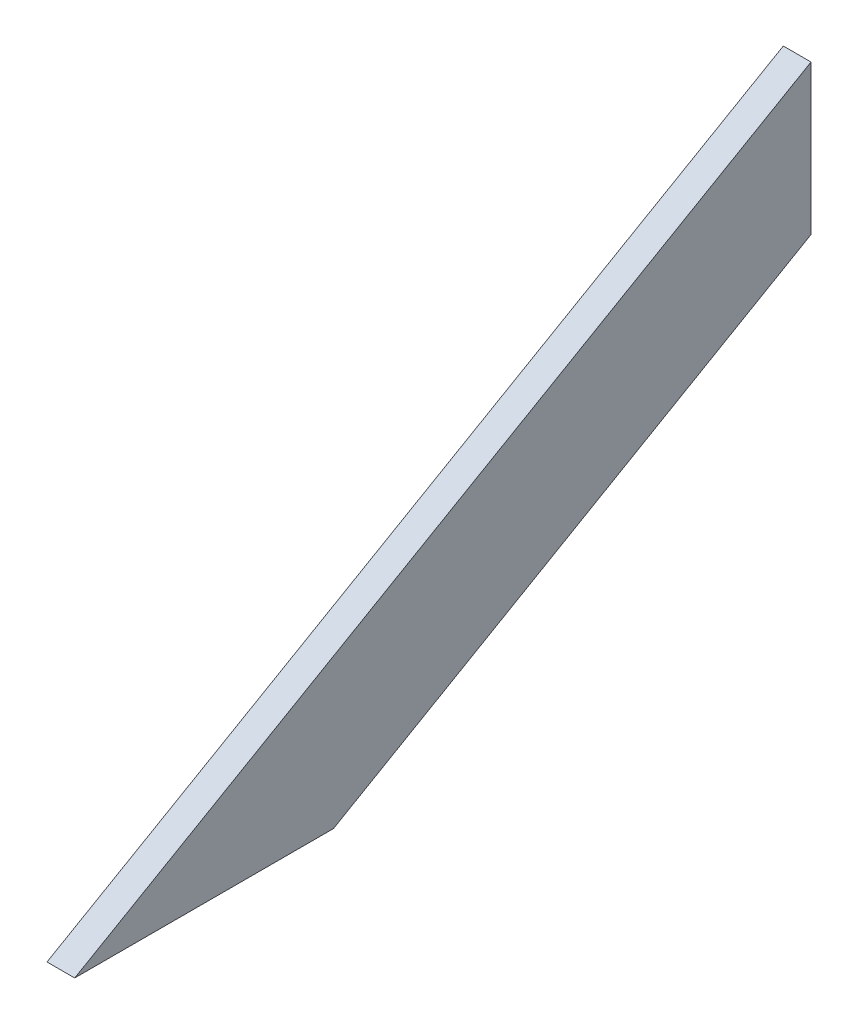
ISO-10303-21;
HEADER;
FILE_DESCRIPTION(('STEP AP214'),'2;1');
FILE_NAME('part.step','',(''),(''),'','','');
FILE_SCHEMA(('AUTOMOTIVE_DESIGN { 1 0 10303 214 1 1 1 1 }'));
ENDSEC;
DATA;
#1=APPLICATION_CONTEXT('core data for automotive mechanical design processes');
#2=APPLICATION_PROTOCOL_DEFINITION('international standard','automotive_design',2000,#1);
#3=PRODUCT_CONTEXT('',#1,'mechanical');
#4=PRODUCT('Part','Part','',(#3));
#5=PRODUCT_RELATED_PRODUCT_CATEGORY('part','',(#4));
#6=PRODUCT_DEFINITION_FORMATION('','',#4);
#7=PRODUCT_DEFINITION_CONTEXT('part definition',#1,'design');
#8=PRODUCT_DEFINITION('design','',#6,#7);
#9=PRODUCT_DEFINITION_SHAPE('','',#8);
#10=(LENGTH_UNIT() NAMED_UNIT(*) SI_UNIT(.MILLI.,.METRE.));
#11=(NAMED_UNIT(*) PLANE_ANGLE_UNIT() SI_UNIT($,.RADIAN.));
#12=(NAMED_UNIT(*) SI_UNIT($,.STERADIAN.) SOLID_ANGLE_UNIT());
#13=UNCERTAINTY_MEASURE_WITH_UNIT(LENGTH_MEASURE(1.E-05),#10,'distance_accuracy_value','');
#14=(GEOMETRIC_REPRESENTATION_CONTEXT(3) GLOBAL_UNCERTAINTY_ASSIGNED_CONTEXT((#13)) GLOBAL_UNIT_ASSIGNED_CONTEXT((#10,
#11,#12)) REPRESENTATION_CONTEXT('',''));
#15=CARTESIAN_POINT('',(0.,0.,0.));
#16=DIRECTION('',(0.,0.,1.));
#17=DIRECTION('',(1.,0.,0.));
#18=AXIS2_PLACEMENT_3D('',#15,#16,#17);
#19=CARTESIAN_POINT('',(19.05,292.099999999997,-505.932040890871));
#20=DIRECTION('',(0.,-0.866025403784442,-0.499999999999995));
#21=DIRECTION('',(0.,0.499999999999995,-0.866025403784442));
#22=AXIS2_PLACEMENT_3D('',#19,#20,#21);
#23=PLANE('',#22);
#24=DIRECTION('',(0.,-0.499999999999995,0.866025403784442));
#25=VECTOR('',#24,1.);
#26=CARTESIAN_POINT('',(0.,292.099999999997,-505.932040890871));
#27=LINE('',#26,#25);
#28=CARTESIAN_POINT('',(0.,292.099999999997,-505.932040890871));
#29=VERTEX_POINT('',#28);
#30=CARTESIAN_POINT('',(0.,0.,0.));
#31=VERTEX_POINT('',#30);
#32=EDGE_CURVE('E96',#29,#31,#27,.T.);
#33=ORIENTED_EDGE('',*,*,#32,.T.);
#34=DIRECTION('',(-1.,0.,0.));
#35=VECTOR('',#34,1.);
#36=CARTESIAN_POINT('',(19.05,0.,0.));
#37=LINE('',#36,#35);
#38=CARTESIAN_POINT('',(19.05,0.,0.));
#39=VERTEX_POINT('',#38);
#40=EDGE_CURVE('E11',#39,#31,#37,.T.);
#41=ORIENTED_EDGE('',*,*,#40,.F.);
#42=DIRECTION('',(0.,-0.499999999999995,0.866025403784442));
#43=VECTOR('',#42,1.);
#44=CARTESIAN_POINT('',(19.05,292.099999999997,-505.932040890871));
#45=LINE('',#44,#43);
#46=CARTESIAN_POINT('',(19.05,292.099999999997,-505.932040890871));
#47=VERTEX_POINT('',#46);
#48=EDGE_CURVE('E84',#47,#39,#45,.T.);
#49=ORIENTED_EDGE('',*,*,#48,.F.);
#50=DIRECTION('',(-1.,0.,0.));
#51=VECTOR('',#50,1.);
#52=CARTESIAN_POINT('',(19.05,292.099999999997,-505.932040890871));
#53=LINE('',#52,#51);
#54=EDGE_CURVE('E92',#47,#29,#53,.T.);
#55=ORIENTED_EDGE('',*,*,#54,.T.);
#56=EDGE_LOOP('',(#33,#41,#49,#55));
#57=FACE_BOUND('',#56,.T.);
#58=ADVANCED_FACE('F33',(#57),#23,.F.);
#59=CARTESIAN_POINT('',(19.05,0.,0.));
#60=DIRECTION('',(0.,1.,0.));
#61=DIRECTION('',(0.,0.,1.));
#62=AXIS2_PLACEMENT_3D('',#59,#60,#61);
#63=PLANE('',#62);
#64=DIRECTION('',(0.,0.,-1.));
#65=VECTOR('',#64,1.);
#66=CARTESIAN_POINT('',(0.,0.,0.));
#67=LINE('',#66,#65);
#68=CARTESIAN_POINT('',(0.,0.,-177.800000000002));
#69=VERTEX_POINT('',#68);
#70=EDGE_CURVE('E88',#31,#69,#67,.T.);
#71=ORIENTED_EDGE('',*,*,#70,.T.);
#72=DIRECTION('',(-1.,0.,0.));
#73=VECTOR('',#72,1.);
#74=CARTESIAN_POINT('',(19.05,0.,-177.800000000002));
#75=LINE('',#74,#73);
#76=CARTESIAN_POINT('',(19.05,0.,-177.800000000002));
#77=VERTEX_POINT('',#76);
#78=EDGE_CURVE('E41',#77,#69,#75,.T.);
#79=ORIENTED_EDGE('',*,*,#78,.F.);
#80=DIRECTION('',(0.,0.,-1.));
#81=VECTOR('',#80,1.);
#82=CARTESIAN_POINT('',(19.05,0.,0.));
#83=LINE('',#82,#81);
#84=EDGE_CURVE('E79',#39,#77,#83,.T.);
#85=ORIENTED_EDGE('',*,*,#84,.F.);
#86=ORIENTED_EDGE('',*,*,#40,.T.);
#87=EDGE_LOOP('',(#71,#79,#85,#86));
#88=FACE_BOUND('',#87,.T.);
#89=ADVANCED_FACE('F87',(#88),#63,.F.);
#90=CARTESIAN_POINT('',(19.05,0.,-177.800000000002));
#91=DIRECTION('',(0.,0.866025403784442,0.499999999999995));
#92=DIRECTION('',(0.,-0.499999999999995,0.866025403784442));
#93=AXIS2_PLACEMENT_3D('',#90,#91,#92);
#94=PLANE('',#93);
#95=DIRECTION('',(0.,0.499999999999995,-0.866025403784442));
#96=VECTOR('',#95,1.);
#97=CARTESIAN_POINT('',(0.,0.,-177.800000000002));
#98=LINE('',#97,#96);
#99=CARTESIAN_POINT('',(0.,189.447122138082,-505.932040890871));
#100=VERTEX_POINT('',#99);
#101=EDGE_CURVE('E66',#69,#100,#98,.T.);
#102=ORIENTED_EDGE('',*,*,#101,.T.);
#103=DIRECTION('',(-1.,0.,0.));
#104=VECTOR('',#103,1.);
#105=CARTESIAN_POINT('',(19.05,189.447122138082,-505.932040890871));
#106=LINE('',#105,#104);
#107=CARTESIAN_POINT('',(19.05,189.447122138082,-505.932040890871));
#108=VERTEX_POINT('',#107);
#109=EDGE_CURVE('E89',#108,#100,#106,.T.);
#110=ORIENTED_EDGE('',*,*,#109,.F.);
#111=DIRECTION('',(0.,0.499999999999995,-0.866025403784442));
#112=VECTOR('',#111,1.);
#113=CARTESIAN_POINT('',(19.05,0.,-177.800000000002));
#114=LINE('',#113,#112);
#115=EDGE_CURVE('E82',#77,#108,#114,.T.);
#116=ORIENTED_EDGE('',*,*,#115,.F.);
#117=ORIENTED_EDGE('',*,*,#78,.T.);
#118=EDGE_LOOP('',(#102,#110,#116,#117));
#119=FACE_BOUND('',#118,.T.);
#120=ADVANCED_FACE('F90',(#119),#94,.F.);
#121=CARTESIAN_POINT('',(19.05,189.447122138082,-505.932040890871));
#122=DIRECTION('',(0.,0.,1.));
#123=DIRECTION('',(1.,0.,0.));
#124=AXIS2_PLACEMENT_3D('',#121,#122,#123);
#125=PLANE('',#124);
#126=DIRECTION('',(0.,1.,0.));
#127=VECTOR('',#126,1.);
#128=CARTESIAN_POINT('',(0.,189.447122138082,-505.932040890871));
#129=LINE('',#128,#127);
#130=EDGE_CURVE('E72',#100,#29,#129,.T.);
#131=ORIENTED_EDGE('',*,*,#130,.T.);
#132=ORIENTED_EDGE('',*,*,#54,.F.);
#133=DIRECTION('',(0.,1.,0.));
#134=VECTOR('',#133,1.);
#135=CARTESIAN_POINT('',(19.05,189.447122138082,-505.932040890871));
#136=LINE('',#135,#134);
#137=EDGE_CURVE('E49',#108,#47,#136,.T.);
#138=ORIENTED_EDGE('',*,*,#137,.F.);
#139=ORIENTED_EDGE('',*,*,#109,.T.);
#140=EDGE_LOOP('',(#131,#132,#138,#139));
#141=FACE_BOUND('',#140,.T.);
#142=ADVANCED_FACE('F103',(#141),#125,.F.);
#143=CARTESIAN_POINT('',(19.05,0.,0.));
#144=DIRECTION('',(-1.,0.,0.));
#145=DIRECTION('',(0.,0.,1.));
#146=AXIS2_PLACEMENT_3D('',#143,#144,#145);
#147=PLANE('',#146);
#148=ORIENTED_EDGE('',*,*,#48,.T.);
#149=ORIENTED_EDGE('',*,*,#84,.T.);
#150=ORIENTED_EDGE('',*,*,#115,.T.);
#151=ORIENTED_EDGE('',*,*,#137,.T.);
#152=EDGE_LOOP('',(#148,#149,#150,#151));
#153=FACE_BOUND('',#152,.T.);
#154=ADVANCED_FACE('F80',(#153),#147,.F.);
#155=CARTESIAN_POINT('',(0.,0.,0.));
#156=DIRECTION('',(-1.,0.,0.));
#157=DIRECTION('',(0.,0.,1.));
#158=AXIS2_PLACEMENT_3D('',#155,#156,#157);
#159=PLANE('',#158);
#160=ORIENTED_EDGE('',*,*,#32,.F.);
#161=ORIENTED_EDGE('',*,*,#130,.F.);
#162=ORIENTED_EDGE('',*,*,#101,.F.);
#163=ORIENTED_EDGE('',*,*,#70,.F.);
#164=EDGE_LOOP('',(#160,#161,#162,#163));
#165=FACE_BOUND('',#164,.T.);
#166=ADVANCED_FACE('F106',(#165),#159,.T.);
#167=CLOSED_SHELL('',(#58,#89,#120,#142,#154,#166));
#168=MANIFOLD_SOLID_BREP('B2',#167);
#169=ADVANCED_BREP_SHAPE_REPRESENTATION('',(#18,#168),#14);
#170=SHAPE_DEFINITION_REPRESENTATION(#9,#169);
ENDSEC;
END-ISO-10303-21;
